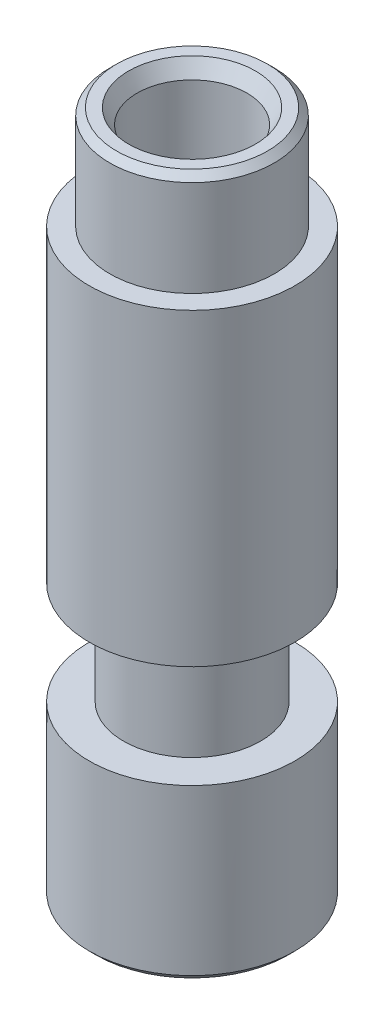
ISO-10303-21;
HEADER;
FILE_DESCRIPTION(('STEP AP214'),'2;1');
FILE_NAME('part.step','',(''),(''),'','','');
FILE_SCHEMA(('AUTOMOTIVE_DESIGN { 1 0 10303 214 1 1 1 1 }'));
ENDSEC;
DATA;
#1=APPLICATION_CONTEXT('core data for automotive mechanical design processes');
#2=APPLICATION_PROTOCOL_DEFINITION('international standard','automotive_design',2000,#1);
#3=PRODUCT_CONTEXT('',#1,'mechanical');
#4=PRODUCT('Part','Part','',(#3));
#5=PRODUCT_RELATED_PRODUCT_CATEGORY('part','',(#4));
#6=PRODUCT_DEFINITION_FORMATION('','',#4);
#7=PRODUCT_DEFINITION_CONTEXT('part definition',#1,'design');
#8=PRODUCT_DEFINITION('design','',#6,#7);
#9=PRODUCT_DEFINITION_SHAPE('','',#8);
#10=(LENGTH_UNIT() NAMED_UNIT(*) SI_UNIT(.MILLI.,.METRE.));
#11=(NAMED_UNIT(*) PLANE_ANGLE_UNIT() SI_UNIT($,.RADIAN.));
#12=(NAMED_UNIT(*) SI_UNIT($,.STERADIAN.) SOLID_ANGLE_UNIT());
#13=UNCERTAINTY_MEASURE_WITH_UNIT(LENGTH_MEASURE(1.E-05),#10,'distance_accuracy_value','');
#14=(GEOMETRIC_REPRESENTATION_CONTEXT(3) GLOBAL_UNCERTAINTY_ASSIGNED_CONTEXT((#13)) GLOBAL_UNIT_ASSIGNED_CONTEXT((#10,
#11,#12)) REPRESENTATION_CONTEXT('',''));
#15=CARTESIAN_POINT('',(0.,0.,0.));
#16=DIRECTION('',(0.,0.,1.));
#17=DIRECTION('',(1.,0.,0.));
#18=AXIS2_PLACEMENT_3D('',#15,#16,#17);
#19=CARTESIAN_POINT('',(-3.,0.,0.));
#20=DIRECTION('',(0.,1.,0.));
#21=DIRECTION('',(0.,0.,1.));
#22=AXIS2_PLACEMENT_3D('',#19,#20,#21);
#23=PLANE('',#22);
#24=CARTESIAN_POINT('',(0.,0.,0.));
#25=DIRECTION('',(0.,1.,0.));
#26=DIRECTION('',(0.,0.,1.));
#27=AXIS2_PLACEMENT_3D('',#24,#25,#26);
#28=CIRCLE('',#27,2.8);
#29=CARTESIAN_POINT('',(0.,0.,2.8));
#30=VERTEX_POINT('',#29);
#31=EDGE_CURVE('E57',#30,#30,#28,.F.);
#32=ORIENTED_EDGE('',*,*,#31,.T.);
#33=EDGE_LOOP('',(#32));
#34=FACE_BOUND('',#33,.T.);
#35=CARTESIAN_POINT('',(0.,0.,0.));
#36=DIRECTION('',(0.,-1.,0.));
#37=DIRECTION('',(0.,0.,-1.));
#38=AXIS2_PLACEMENT_3D('',#35,#36,#37);
#39=CIRCLE('',#38,1.6);
#40=CARTESIAN_POINT('',(0.,0.,-1.6));
#41=VERTEX_POINT('',#40);
#42=EDGE_CURVE('E60',#41,#41,#39,.T.);
#43=ORIENTED_EDGE('',*,*,#42,.F.);
#44=EDGE_LOOP('',(#43));
#45=FACE_BOUND('',#44,.T.);
#46=ADVANCED_FACE('F34',(#34,#45),#23,.F.);
#47=CARTESIAN_POINT('',(0.,0.,0.));
#48=DIRECTION('',(0.,-1.,0.));
#49=DIRECTION('',(0.,0.,-1.));
#50=AXIS2_PLACEMENT_3D('',#47,#48,#49);
#51=CYLINDRICAL_SURFACE('',#50,1.6);
#52=CARTESIAN_POINT('',(0.,19.5669872981078,0.));
#53=DIRECTION('',(0.,-1.,0.));
#54=DIRECTION('',(0.,0.,-1.));
#55=AXIS2_PLACEMENT_3D('',#52,#53,#54);
#56=CIRCLE('',#55,1.6);
#57=CARTESIAN_POINT('',(0.,19.5669872981078,-1.6));
#58=VERTEX_POINT('',#57);
#59=EDGE_CURVE('E10',#58,#58,#56,.F.);
#60=ORIENTED_EDGE('',*,*,#59,.T.);
#61=EDGE_LOOP('',(#60));
#62=FACE_BOUND('',#61,.T.);
#63=ORIENTED_EDGE('',*,*,#42,.T.);
#64=EDGE_LOOP('',(#63));
#65=FACE_BOUND('',#64,.T.);
#66=ADVANCED_FACE('F122',(#62,#65),#51,.F.);
#67=CARTESIAN_POINT('',(-1.6,20.,0.));
#68=DIRECTION('',(0.,-1.,0.));
#69=DIRECTION('',(0.,0.,-1.));
#70=AXIS2_PLACEMENT_3D('',#67,#68,#69);
#71=PLANE('',#70);
#72=CARTESIAN_POINT('',(0.,20.,0.));
#73=DIRECTION('',(0.,-1.,0.));
#74=DIRECTION('',(0.,0.,-1.));
#75=AXIS2_PLACEMENT_3D('',#72,#73,#74);
#76=CIRCLE('',#75,1.85000000000001);
#77=CARTESIAN_POINT('',(0.,20.,-1.85000000000001));
#78=VERTEX_POINT('',#77);
#79=EDGE_CURVE('E41',#78,#78,#76,.T.);
#80=ORIENTED_EDGE('',*,*,#79,.T.);
#81=EDGE_LOOP('',(#80));
#82=FACE_BOUND('',#81,.T.);
#83=CARTESIAN_POINT('',(0.,20.,0.));
#84=DIRECTION('',(0.,-1.,0.));
#85=DIRECTION('',(0.,0.,-1.));
#86=AXIS2_PLACEMENT_3D('',#83,#84,#85);
#87=CIRCLE('',#86,2.19999999999999);
#88=CARTESIAN_POINT('',(0.,20.,-2.19999999999999));
#89=VERTEX_POINT('',#88);
#90=EDGE_CURVE('E45',#89,#89,#87,.F.);
#91=ORIENTED_EDGE('',*,*,#90,.T.);
#92=EDGE_LOOP('',(#91));
#93=FACE_BOUND('',#92,.T.);
#94=ADVANCED_FACE('F116',(#82,#93),#71,.F.);
#95=CARTESIAN_POINT('',(0.,0.,0.));
#96=DIRECTION('',(0.,-1.,0.));
#97=DIRECTION('',(0.,0.,-1.));
#98=AXIS2_PLACEMENT_3D('',#95,#96,#97);
#99=CYLINDRICAL_SURFACE('',#98,2.4);
#100=CARTESIAN_POINT('',(0.,19.8,0.));
#101=DIRECTION('',(0.,-1.,0.));
#102=DIRECTION('',(0.,0.,-1.));
#103=AXIS2_PLACEMENT_3D('',#100,#101,#102);
#104=CIRCLE('',#103,2.4);
#105=CARTESIAN_POINT('',(0.,19.8,-2.4));
#106=VERTEX_POINT('',#105);
#107=EDGE_CURVE('E49',#106,#106,#104,.T.);
#108=ORIENTED_EDGE('',*,*,#107,.T.);
#109=EDGE_LOOP('',(#108));
#110=FACE_BOUND('',#109,.T.);
#111=CARTESIAN_POINT('',(0.,17.,0.));
#112=DIRECTION('',(0.,-1.,0.));
#113=DIRECTION('',(0.,0.,-1.));
#114=AXIS2_PLACEMENT_3D('',#111,#112,#113);
#115=CIRCLE('',#114,2.4);
#116=CARTESIAN_POINT('',(0.,17.,-2.4));
#117=VERTEX_POINT('',#116);
#118=EDGE_CURVE('E63',#117,#117,#115,.T.);
#119=ORIENTED_EDGE('',*,*,#118,.F.);
#120=EDGE_LOOP('',(#119));
#121=FACE_BOUND('',#120,.T.);
#122=ADVANCED_FACE('F111',(#110,#121),#99,.T.);
#123=CARTESIAN_POINT('',(-2.4,17.,0.));
#124=DIRECTION('',(0.,-1.,0.));
#125=DIRECTION('',(0.,0.,-1.));
#126=AXIS2_PLACEMENT_3D('',#123,#124,#125);
#127=PLANE('',#126);
#128=CARTESIAN_POINT('',(0.,17.,0.));
#129=DIRECTION('',(0.,-1.,0.));
#130=DIRECTION('',(0.,0.,-1.));
#131=AXIS2_PLACEMENT_3D('',#128,#129,#130);
#132=CIRCLE('',#131,3.);
#133=CARTESIAN_POINT('',(0.,17.,-3.));
#134=VERTEX_POINT('',#133);
#135=EDGE_CURVE('E66',#134,#134,#132,.T.);
#136=ORIENTED_EDGE('',*,*,#135,.F.);
#137=EDGE_LOOP('',(#136));
#138=FACE_BOUND('',#137,.T.);
#139=ORIENTED_EDGE('',*,*,#118,.T.);
#140=EDGE_LOOP('',(#139));
#141=FACE_BOUND('',#140,.T.);
#142=ADVANCED_FACE('F105',(#138,#141),#127,.F.);
#143=CARTESIAN_POINT('',(0.,0.,0.));
#144=DIRECTION('',(0.,-1.,0.));
#145=DIRECTION('',(0.,0.,-1.));
#146=AXIS2_PLACEMENT_3D('',#143,#144,#145);
#147=CYLINDRICAL_SURFACE('',#146,3.);
#148=CARTESIAN_POINT('',(0.,8.,0.));
#149=DIRECTION('',(0.,-1.,0.));
#150=DIRECTION('',(0.,0.,-1.));
#151=AXIS2_PLACEMENT_3D('',#148,#149,#150);
#152=CIRCLE('',#151,3.);
#153=CARTESIAN_POINT('',(0.,8.,-3.));
#154=VERTEX_POINT('',#153);
#155=EDGE_CURVE('E69',#154,#154,#152,.T.);
#156=ORIENTED_EDGE('',*,*,#155,.F.);
#157=EDGE_LOOP('',(#156));
#158=FACE_BOUND('',#157,.T.);
#159=ORIENTED_EDGE('',*,*,#135,.T.);
#160=EDGE_LOOP('',(#159));
#161=FACE_BOUND('',#160,.T.);
#162=ADVANCED_FACE('F99',(#158,#161),#147,.T.);
#163=CARTESIAN_POINT('',(-3.,8.,0.));
#164=DIRECTION('',(0.,1.,0.));
#165=DIRECTION('',(0.,0.,1.));
#166=AXIS2_PLACEMENT_3D('',#163,#164,#165);
#167=PLANE('',#166);
#168=CARTESIAN_POINT('',(0.,8.,0.));
#169=DIRECTION('',(0.,-1.,0.));
#170=DIRECTION('',(0.,0.,-1.));
#171=AXIS2_PLACEMENT_3D('',#168,#169,#170);
#172=CIRCLE('',#171,2.);
#173=CARTESIAN_POINT('',(0.,8.,-2.));
#174=VERTEX_POINT('',#173);
#175=EDGE_CURVE('E72',#174,#174,#172,.T.);
#176=ORIENTED_EDGE('',*,*,#175,.F.);
#177=EDGE_LOOP('',(#176));
#178=FACE_BOUND('',#177,.T.);
#179=ORIENTED_EDGE('',*,*,#155,.T.);
#180=EDGE_LOOP('',(#179));
#181=FACE_BOUND('',#180,.T.);
#182=ADVANCED_FACE('F93',(#178,#181),#167,.F.);
#183=CARTESIAN_POINT('',(0.,0.,0.));
#184=DIRECTION('',(0.,-1.,0.));
#185=DIRECTION('',(0.,0.,-1.));
#186=AXIS2_PLACEMENT_3D('',#183,#184,#185);
#187=CYLINDRICAL_SURFACE('',#186,2.);
#188=CARTESIAN_POINT('',(0.,5.,0.));
#189=DIRECTION('',(0.,-1.,0.));
#190=DIRECTION('',(0.,0.,-1.));
#191=AXIS2_PLACEMENT_3D('',#188,#189,#190);
#192=CIRCLE('',#191,2.);
#193=CARTESIAN_POINT('',(0.,5.,-2.));
#194=VERTEX_POINT('',#193);
#195=EDGE_CURVE('E75',#194,#194,#192,.T.);
#196=ORIENTED_EDGE('',*,*,#195,.F.);
#197=EDGE_LOOP('',(#196));
#198=FACE_BOUND('',#197,.T.);
#199=ORIENTED_EDGE('',*,*,#175,.T.);
#200=EDGE_LOOP('',(#199));
#201=FACE_BOUND('',#200,.T.);
#202=ADVANCED_FACE('F87',(#198,#201),#187,.T.);
#203=CARTESIAN_POINT('',(-2.,5.,0.));
#204=DIRECTION('',(0.,-1.,0.));
#205=DIRECTION('',(0.,0.,-1.));
#206=AXIS2_PLACEMENT_3D('',#203,#204,#205);
#207=PLANE('',#206);
#208=CARTESIAN_POINT('',(0.,5.,0.));
#209=DIRECTION('',(0.,-1.,0.));
#210=DIRECTION('',(0.,0.,-1.));
#211=AXIS2_PLACEMENT_3D('',#208,#209,#210);
#212=CIRCLE('',#211,3.);
#213=CARTESIAN_POINT('',(0.,5.,-3.));
#214=VERTEX_POINT('',#213);
#215=EDGE_CURVE('E78',#214,#214,#212,.T.);
#216=ORIENTED_EDGE('',*,*,#215,.F.);
#217=EDGE_LOOP('',(#216));
#218=FACE_BOUND('',#217,.T.);
#219=ORIENTED_EDGE('',*,*,#195,.T.);
#220=EDGE_LOOP('',(#219));
#221=FACE_BOUND('',#220,.T.);
#222=ADVANCED_FACE('F84',(#218,#221),#207,.F.);
#223=CARTESIAN_POINT('',(0.,0.,0.));
#224=DIRECTION('',(0.,-1.,0.));
#225=DIRECTION('',(0.,0.,-1.));
#226=AXIS2_PLACEMENT_3D('',#223,#224,#225);
#227=CYLINDRICAL_SURFACE('',#226,3.);
#228=CARTESIAN_POINT('',(0.,0.2,0.));
#229=DIRECTION('',(0.,1.,0.));
#230=DIRECTION('',(0.,0.,1.));
#231=AXIS2_PLACEMENT_3D('',#228,#229,#230);
#232=CIRCLE('',#231,3.);
#233=CARTESIAN_POINT('',(0.,0.2,3.));
#234=VERTEX_POINT('',#233);
#235=EDGE_CURVE('E54',#234,#234,#232,.T.);
#236=ORIENTED_EDGE('',*,*,#235,.T.);
#237=EDGE_LOOP('',(#236));
#238=FACE_BOUND('',#237,.T.);
#239=ORIENTED_EDGE('',*,*,#215,.T.);
#240=EDGE_LOOP('',(#239));
#241=FACE_BOUND('',#240,.T.);
#242=ADVANCED_FACE('F82',(#238,#241),#227,.T.);
#243=CARTESIAN_POINT('',(0.,0.,0.));
#244=DIRECTION('',(0.,1.,0.));
#245=DIRECTION('',(0.,0.,1.));
#246=AXIS2_PLACEMENT_3D('',#243,#244,#245);
#247=CONICAL_SURFACE('',#246,2.8,0.785398163397443);
#248=ORIENTED_EDGE('',*,*,#235,.F.);
#249=EDGE_LOOP('',(#248));
#250=FACE_BOUND('',#249,.T.);
#251=ORIENTED_EDGE('',*,*,#31,.F.);
#252=EDGE_LOOP('',(#251));
#253=FACE_BOUND('',#252,.T.);
#254=ADVANCED_FACE('F133',(#250,#253),#247,.T.);
#255=CARTESIAN_POINT('',(0.,19.8,0.));
#256=DIRECTION('',(0.,-1.,0.));
#257=DIRECTION('',(0.,0.,-1.));
#258=AXIS2_PLACEMENT_3D('',#255,#256,#257);
#259=CONICAL_SURFACE('',#258,2.4,0.785398163397455);
#260=ORIENTED_EDGE('',*,*,#90,.F.);
#261=EDGE_LOOP('',(#260));
#262=FACE_BOUND('',#261,.T.);
#263=ORIENTED_EDGE('',*,*,#107,.F.);
#264=EDGE_LOOP('',(#263));
#265=FACE_BOUND('',#264,.T.);
#266=ADVANCED_FACE('F135',(#262,#265),#259,.T.);
#267=CARTESIAN_POINT('',(0.,20.,0.));
#268=DIRECTION('',(0.,1.,0.));
#269=DIRECTION('',(0.,0.,1.));
#270=AXIS2_PLACEMENT_3D('',#267,#268,#269);
#271=CONICAL_SURFACE('',#270,1.85000000000001,0.523598775598297);
#272=ORIENTED_EDGE('',*,*,#59,.F.);
#273=EDGE_LOOP('',(#272));
#274=FACE_BOUND('',#273,.T.);
#275=ORIENTED_EDGE('',*,*,#79,.F.);
#276=EDGE_LOOP('',(#275));
#277=FACE_BOUND('',#276,.T.);
#278=ADVANCED_FACE('F36',(#274,#277),#271,.F.);
#279=CLOSED_SHELL('',(#46,#66,#94,#122,#142,#162,#182,#202,#222,#242,#254,#266,#278));
#280=MANIFOLD_SOLID_BREP('B2',#279);
#281=ADVANCED_BREP_SHAPE_REPRESENTATION('',(#18,#280),#14);
#282=SHAPE_DEFINITION_REPRESENTATION(#9,#281);
ENDSEC;
END-ISO-10303-21;
